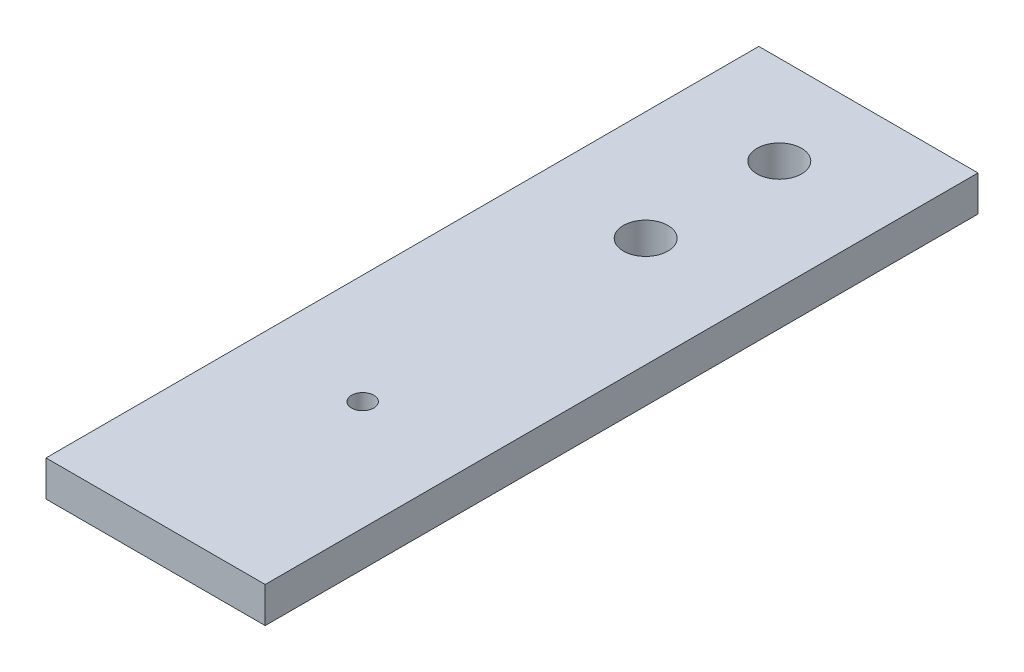
ISO-10303-21;
HEADER;
FILE_DESCRIPTION(('STEP AP214'),'2;1');
FILE_NAME('part.step','',(''),(''),'','','');
FILE_SCHEMA(('AUTOMOTIVE_DESIGN { 1 0 10303 214 1 1 1 1 }'));
ENDSEC;
DATA;
#1=APPLICATION_CONTEXT('core data for automotive mechanical design processes');
#2=APPLICATION_PROTOCOL_DEFINITION('international standard','automotive_design',2000,#1);
#3=PRODUCT_CONTEXT('',#1,'mechanical');
#4=PRODUCT('Part','Part','',(#3));
#5=PRODUCT_RELATED_PRODUCT_CATEGORY('part','',(#4));
#6=PRODUCT_DEFINITION_FORMATION('','',#4);
#7=PRODUCT_DEFINITION_CONTEXT('part definition',#1,'design');
#8=PRODUCT_DEFINITION('design','',#6,#7);
#9=PRODUCT_DEFINITION_SHAPE('','',#8);
#10=(LENGTH_UNIT() NAMED_UNIT(*) SI_UNIT(.MILLI.,.METRE.));
#11=(NAMED_UNIT(*) PLANE_ANGLE_UNIT() SI_UNIT($,.RADIAN.));
#12=(NAMED_UNIT(*) SI_UNIT($,.STERADIAN.) SOLID_ANGLE_UNIT());
#13=UNCERTAINTY_MEASURE_WITH_UNIT(LENGTH_MEASURE(1.E-05),#10,'distance_accuracy_value','');
#14=(GEOMETRIC_REPRESENTATION_CONTEXT(3) GLOBAL_UNCERTAINTY_ASSIGNED_CONTEXT((#13)) GLOBAL_UNIT_ASSIGNED_CONTEXT((#10,
#11,#12)) REPRESENTATION_CONTEXT('',''));
#15=CARTESIAN_POINT('',(0.,0.,0.));
#16=DIRECTION('',(0.,0.,1.));
#17=DIRECTION('',(1.,0.,0.));
#18=AXIS2_PLACEMENT_3D('',#15,#16,#17);
#19=CARTESIAN_POINT('',(0.,5.08,0.));
#20=DIRECTION('',(1.,0.,0.));
#21=DIRECTION('',(0.,0.,-1.));
#22=AXIS2_PLACEMENT_3D('',#19,#20,#21);
#23=PLANE('',#22);
#24=DIRECTION('',(0.,0.,1.));
#25=VECTOR('',#24,1.);
#26=CARTESIAN_POINT('',(0.,0.,0.));
#27=LINE('',#26,#25);
#28=CARTESIAN_POINT('',(0.,0.,-101.6));
#29=VERTEX_POINT('',#28);
#30=CARTESIAN_POINT('',(0.,0.,0.));
#31=VERTEX_POINT('',#30);
#32=EDGE_CURVE('E110',#29,#31,#27,.T.);
#33=ORIENTED_EDGE('',*,*,#32,.T.);
#34=DIRECTION('',(0.,-1.,0.));
#35=VECTOR('',#34,1.);
#36=CARTESIAN_POINT('',(0.,5.08,0.));
#37=LINE('',#36,#35);
#38=CARTESIAN_POINT('',(0.,5.08,0.));
#39=VERTEX_POINT('',#38);
#40=EDGE_CURVE('E11',#39,#31,#37,.T.);
#41=ORIENTED_EDGE('',*,*,#40,.F.);
#42=DIRECTION('',(0.,0.,1.));
#43=VECTOR('',#42,1.);
#44=CARTESIAN_POINT('',(0.,5.08,0.));
#45=LINE('',#44,#43);
#46=CARTESIAN_POINT('',(0.,5.08,-101.6));
#47=VERTEX_POINT('',#46);
#48=EDGE_CURVE('E94',#47,#39,#45,.T.);
#49=ORIENTED_EDGE('',*,*,#48,.F.);
#50=DIRECTION('',(0.,-1.,0.));
#51=VECTOR('',#50,1.);
#52=CARTESIAN_POINT('',(0.,5.08,-101.6));
#53=LINE('',#52,#51);
#54=EDGE_CURVE('E106',#47,#29,#53,.T.);
#55=ORIENTED_EDGE('',*,*,#54,.T.);
#56=EDGE_LOOP('',(#33,#41,#49,#55));
#57=FACE_BOUND('',#56,.T.);
#58=ADVANCED_FACE('F42',(#57),#23,.F.);
#59=CARTESIAN_POINT('',(0.,5.08,0.));
#60=DIRECTION('',(0.,0.,-1.));
#61=DIRECTION('',(-1.,0.,0.));
#62=AXIS2_PLACEMENT_3D('',#59,#60,#61);
#63=PLANE('',#62);
#64=DIRECTION('',(1.,0.,0.));
#65=VECTOR('',#64,1.);
#66=CARTESIAN_POINT('',(0.,0.,0.));
#67=LINE('',#66,#65);
#68=CARTESIAN_POINT('',(31.242,0.,0.));
#69=VERTEX_POINT('',#68);
#70=EDGE_CURVE('E99',#31,#69,#67,.T.);
#71=ORIENTED_EDGE('',*,*,#70,.T.);
#72=DIRECTION('',(0.,-1.,0.));
#73=VECTOR('',#72,1.);
#74=CARTESIAN_POINT('',(31.242,5.08,0.));
#75=LINE('',#74,#73);
#76=CARTESIAN_POINT('',(31.242,5.08,0.));
#77=VERTEX_POINT('',#76);
#78=EDGE_CURVE('E51',#77,#69,#75,.T.);
#79=ORIENTED_EDGE('',*,*,#78,.F.);
#80=DIRECTION('',(1.,0.,0.));
#81=VECTOR('',#80,1.);
#82=CARTESIAN_POINT('',(0.,5.08,0.));
#83=LINE('',#82,#81);
#84=EDGE_CURVE('E89',#39,#77,#83,.T.);
#85=ORIENTED_EDGE('',*,*,#84,.F.);
#86=ORIENTED_EDGE('',*,*,#40,.T.);
#87=EDGE_LOOP('',(#71,#79,#85,#86));
#88=FACE_BOUND('',#87,.T.);
#89=ADVANCED_FACE('F98',(#88),#63,.F.);
#90=CARTESIAN_POINT('',(31.242,5.08,0.));
#91=DIRECTION('',(-1.,0.,0.));
#92=DIRECTION('',(0.,0.,1.));
#93=AXIS2_PLACEMENT_3D('',#90,#91,#92);
#94=PLANE('',#93);
#95=DIRECTION('',(0.,0.,-1.));
#96=VECTOR('',#95,1.);
#97=CARTESIAN_POINT('',(31.242,0.,0.));
#98=LINE('',#97,#96);
#99=CARTESIAN_POINT('',(31.242,0.,-101.6));
#100=VERTEX_POINT('',#99);
#101=EDGE_CURVE('E76',#69,#100,#98,.T.);
#102=ORIENTED_EDGE('',*,*,#101,.T.);
#103=DIRECTION('',(0.,-1.,0.));
#104=VECTOR('',#103,1.);
#105=CARTESIAN_POINT('',(31.242,5.08,-101.6));
#106=LINE('',#105,#104);
#107=CARTESIAN_POINT('',(31.242,5.08,-101.6));
#108=VERTEX_POINT('',#107);
#109=EDGE_CURVE('E101',#108,#100,#106,.T.);
#110=ORIENTED_EDGE('',*,*,#109,.F.);
#111=DIRECTION('',(0.,0.,-1.));
#112=VECTOR('',#111,1.);
#113=CARTESIAN_POINT('',(31.242,5.08,0.));
#114=LINE('',#113,#112);
#115=EDGE_CURVE('E92',#77,#108,#114,.T.);
#116=ORIENTED_EDGE('',*,*,#115,.F.);
#117=ORIENTED_EDGE('',*,*,#78,.T.);
#118=EDGE_LOOP('',(#102,#110,#116,#117));
#119=FACE_BOUND('',#118,.T.);
#120=ADVANCED_FACE('F102',(#119),#94,.F.);
#121=CARTESIAN_POINT('',(0.,5.08,-101.6));
#122=DIRECTION('',(0.,0.,1.));
#123=DIRECTION('',(1.,0.,0.));
#124=AXIS2_PLACEMENT_3D('',#121,#122,#123);
#125=PLANE('',#124);
#126=DIRECTION('',(-1.,0.,0.));
#127=VECTOR('',#126,1.);
#128=CARTESIAN_POINT('',(0.,0.,-101.6));
#129=LINE('',#128,#127);
#130=EDGE_CURVE('E82',#100,#29,#129,.T.);
#131=ORIENTED_EDGE('',*,*,#130,.T.);
#132=ORIENTED_EDGE('',*,*,#54,.F.);
#133=DIRECTION('',(-1.,0.,0.));
#134=VECTOR('',#133,1.);
#135=CARTESIAN_POINT('',(0.,5.08,-101.6));
#136=LINE('',#135,#134);
#137=EDGE_CURVE('E59',#108,#47,#136,.T.);
#138=ORIENTED_EDGE('',*,*,#137,.F.);
#139=ORIENTED_EDGE('',*,*,#109,.T.);
#140=EDGE_LOOP('',(#131,#132,#138,#139));
#141=FACE_BOUND('',#140,.T.);
#142=ADVANCED_FACE('F124',(#141),#125,.F.);
#143=CARTESIAN_POINT('',(0.,5.08,0.));
#144=DIRECTION('',(0.,-1.,0.));
#145=DIRECTION('',(0.,0.,-1.));
#146=AXIS2_PLACEMENT_3D('',#143,#144,#145);
#147=PLANE('',#146);
#148=CARTESIAN_POINT('',(15.621,5.08,-29.5148));
#149=DIRECTION('',(0.,-1.,0.));
#150=DIRECTION('',(0.,0.,-1.));
#151=AXIS2_PLACEMENT_3D('',#148,#149,#150);
#152=CIRCLE('',#151,1.58749999999999);
#153=CARTESIAN_POINT('',(15.621,5.08,-31.1023));
#154=VERTEX_POINT('',#153);
#155=EDGE_CURVE('E146',#154,#154,#152,.T.);
#156=ORIENTED_EDGE('',*,*,#155,.T.);
#157=EDGE_LOOP('',(#156));
#158=FACE_BOUND('',#157,.T.);
#159=CARTESIAN_POINT('',(15.621,5.08,-69.85));
#160=DIRECTION('',(0.,-1.,0.));
#161=DIRECTION('',(0.,0.,-1.));
#162=AXIS2_PLACEMENT_3D('',#159,#160,#161);
#163=CIRCLE('',#162,3.17499999999999);
#164=CARTESIAN_POINT('',(15.621,5.08,-73.025));
#165=VERTEX_POINT('',#164);
#166=EDGE_CURVE('E138',#165,#165,#163,.T.);
#167=ORIENTED_EDGE('',*,*,#166,.T.);
#168=EDGE_LOOP('',(#167));
#169=FACE_BOUND('',#168,.T.);
#170=CARTESIAN_POINT('',(15.621,5.08,-88.9));
#171=DIRECTION('',(0.,-1.,0.));
#172=DIRECTION('',(0.,0.,-1.));
#173=AXIS2_PLACEMENT_3D('',#170,#171,#172);
#174=CIRCLE('',#173,3.17499999999999);
#175=CARTESIAN_POINT('',(15.621,5.08,-92.075));
#176=VERTEX_POINT('',#175);
#177=EDGE_CURVE('E114',#176,#176,#174,.T.);
#178=ORIENTED_EDGE('',*,*,#177,.T.);
#179=EDGE_LOOP('',(#178));
#180=FACE_BOUND('',#179,.T.);
#181=ORIENTED_EDGE('',*,*,#48,.T.);
#182=ORIENTED_EDGE('',*,*,#84,.T.);
#183=ORIENTED_EDGE('',*,*,#115,.T.);
#184=ORIENTED_EDGE('',*,*,#137,.T.);
#185=EDGE_LOOP('',(#181,#182,#183,#184));
#186=FACE_BOUND('',#185,.T.);
#187=ADVANCED_FACE('F90',(#158,#169,#180,#186),#147,.F.);
#188=CARTESIAN_POINT('',(0.,0.,0.));
#189=DIRECTION('',(0.,-1.,0.));
#190=DIRECTION('',(0.,0.,-1.));
#191=AXIS2_PLACEMENT_3D('',#188,#189,#190);
#192=PLANE('',#191);
#193=CARTESIAN_POINT('',(15.621,0.,-29.5148));
#194=DIRECTION('',(0.,-1.,0.));
#195=DIRECTION('',(0.,0.,-1.));
#196=AXIS2_PLACEMENT_3D('',#193,#194,#195);
#197=CIRCLE('',#196,1.58749999999999);
#198=CARTESIAN_POINT('',(15.621,0.,-31.1023));
#199=VERTEX_POINT('',#198);
#200=EDGE_CURVE('E150',#199,#199,#197,.T.);
#201=ORIENTED_EDGE('',*,*,#200,.F.);
#202=EDGE_LOOP('',(#201));
#203=FACE_BOUND('',#202,.T.);
#204=CARTESIAN_POINT('',(15.621,0.,-69.85));
#205=DIRECTION('',(0.,-1.,0.));
#206=DIRECTION('',(0.,0.,-1.));
#207=AXIS2_PLACEMENT_3D('',#204,#205,#206);
#208=CIRCLE('',#207,3.17499999999999);
#209=CARTESIAN_POINT('',(15.621,0.,-73.025));
#210=VERTEX_POINT('',#209);
#211=EDGE_CURVE('E142',#210,#210,#208,.T.);
#212=ORIENTED_EDGE('',*,*,#211,.F.);
#213=EDGE_LOOP('',(#212));
#214=FACE_BOUND('',#213,.T.);
#215=CARTESIAN_POINT('',(15.621,0.,-88.9));
#216=DIRECTION('',(0.,-1.,0.));
#217=DIRECTION('',(0.,0.,-1.));
#218=AXIS2_PLACEMENT_3D('',#215,#216,#217);
#219=CIRCLE('',#218,3.17499999999999);
#220=CARTESIAN_POINT('',(15.621,0.,-92.075));
#221=VERTEX_POINT('',#220);
#222=EDGE_CURVE('E134',#221,#221,#219,.T.);
#223=ORIENTED_EDGE('',*,*,#222,.F.);
#224=EDGE_LOOP('',(#223));
#225=FACE_BOUND('',#224,.T.);
#226=ORIENTED_EDGE('',*,*,#32,.F.);
#227=ORIENTED_EDGE('',*,*,#130,.F.);
#228=ORIENTED_EDGE('',*,*,#101,.F.);
#229=ORIENTED_EDGE('',*,*,#70,.F.);
#230=EDGE_LOOP('',(#226,#227,#228,#229));
#231=FACE_BOUND('',#230,.T.);
#232=ADVANCED_FACE('F127',(#203,#214,#225,#231),#192,.T.);
#233=CARTESIAN_POINT('',(15.621,0.,-88.9));
#234=DIRECTION('',(0.,-1.,0.));
#235=DIRECTION('',(0.,0.,-1.));
#236=AXIS2_PLACEMENT_3D('',#233,#234,#235);
#237=CYLINDRICAL_SURFACE('',#236,3.17499999999999);
#238=ORIENTED_EDGE('',*,*,#177,.F.);
#239=EDGE_LOOP('',(#238));
#240=FACE_BOUND('',#239,.T.);
#241=ORIENTED_EDGE('',*,*,#222,.T.);
#242=EDGE_LOOP('',(#241));
#243=FACE_BOUND('',#242,.T.);
#244=ADVANCED_FACE('F159',(#240,#243),#237,.F.);
#245=CARTESIAN_POINT('',(15.621,0.,-69.85));
#246=DIRECTION('',(0.,-1.,0.));
#247=DIRECTION('',(0.,0.,-1.));
#248=AXIS2_PLACEMENT_3D('',#245,#246,#247);
#249=CYLINDRICAL_SURFACE('',#248,3.17499999999999);
#250=ORIENTED_EDGE('',*,*,#166,.F.);
#251=EDGE_LOOP('',(#250));
#252=FACE_BOUND('',#251,.T.);
#253=ORIENTED_EDGE('',*,*,#211,.T.);
#254=EDGE_LOOP('',(#253));
#255=FACE_BOUND('',#254,.T.);
#256=ADVANCED_FACE('F166',(#252,#255),#249,.F.);
#257=CARTESIAN_POINT('',(15.621,0.,-29.5148));
#258=DIRECTION('',(0.,-1.,0.));
#259=DIRECTION('',(0.,0.,-1.));
#260=AXIS2_PLACEMENT_3D('',#257,#258,#259);
#261=CYLINDRICAL_SURFACE('',#260,1.58749999999999);
#262=ORIENTED_EDGE('',*,*,#155,.F.);
#263=EDGE_LOOP('',(#262));
#264=FACE_BOUND('',#263,.T.);
#265=ORIENTED_EDGE('',*,*,#200,.T.);
#266=EDGE_LOOP('',(#265));
#267=FACE_BOUND('',#266,.T.);
#268=ADVANCED_FACE('F155',(#264,#267),#261,.F.);
#269=CLOSED_SHELL('',(#58,#89,#120,#142,#187,#232,#244,#256,#268));
#270=MANIFOLD_SOLID_BREP('B2',#269);
#271=ADVANCED_BREP_SHAPE_REPRESENTATION('',(#18,#270),#14);
#272=SHAPE_DEFINITION_REPRESENTATION(#9,#271);
ENDSEC;
END-ISO-10303-21;
